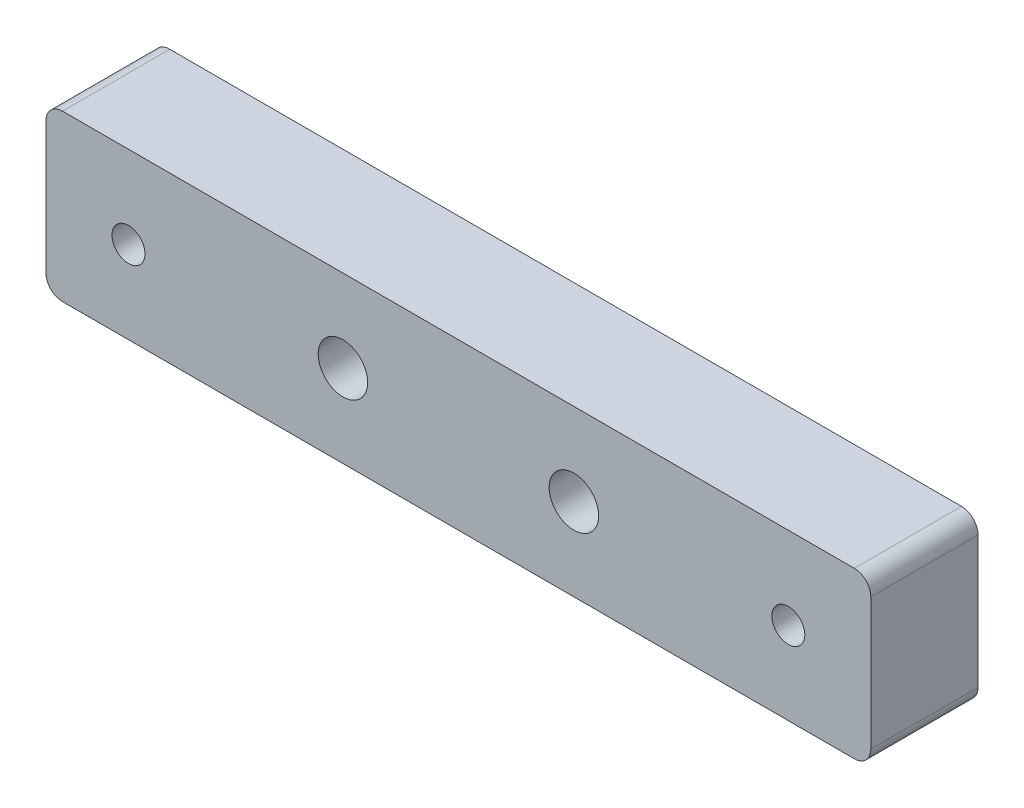
ISO-10303-21;
HEADER;
FILE_DESCRIPTION(('STEP AP214'),'2;1');
FILE_NAME('part.step','',(''),(''),'','','');
FILE_SCHEMA(('AUTOMOTIVE_DESIGN { 1 0 10303 214 1 1 1 1 }'));
ENDSEC;
DATA;
#1=APPLICATION_CONTEXT('core data for automotive mechanical design processes');
#2=APPLICATION_PROTOCOL_DEFINITION('international standard','automotive_design',2000,#1);
#3=PRODUCT_CONTEXT('',#1,'mechanical');
#4=PRODUCT('Part','Part','',(#3));
#5=PRODUCT_RELATED_PRODUCT_CATEGORY('part','',(#4));
#6=PRODUCT_DEFINITION_FORMATION('','',#4);
#7=PRODUCT_DEFINITION_CONTEXT('part definition',#1,'design');
#8=PRODUCT_DEFINITION('design','',#6,#7);
#9=PRODUCT_DEFINITION_SHAPE('','',#8);
#10=(LENGTH_UNIT() NAMED_UNIT(*) SI_UNIT(.MILLI.,.METRE.));
#11=(NAMED_UNIT(*) PLANE_ANGLE_UNIT() SI_UNIT($,.RADIAN.));
#12=(NAMED_UNIT(*) SI_UNIT($,.STERADIAN.) SOLID_ANGLE_UNIT());
#13=UNCERTAINTY_MEASURE_WITH_UNIT(LENGTH_MEASURE(1.E-05),#10,'distance_accuracy_value','');
#14=(GEOMETRIC_REPRESENTATION_CONTEXT(3) GLOBAL_UNCERTAINTY_ASSIGNED_CONTEXT((#13)) GLOBAL_UNIT_ASSIGNED_CONTEXT((#10,
#11,#12)) REPRESENTATION_CONTEXT('',''));
#15=CARTESIAN_POINT('',(0.,0.,0.));
#16=DIRECTION('',(0.,0.,1.));
#17=DIRECTION('',(1.,0.,0.));
#18=AXIS2_PLACEMENT_3D('',#15,#16,#17);
#19=CARTESIAN_POINT('',(0.,0.,13.));
#20=DIRECTION('',(0.,1.,0.));
#21=DIRECTION('',(0.,0.,1.));
#22=AXIS2_PLACEMENT_3D('',#19,#20,#21);
#23=PLANE('',#22);
#24=DIRECTION('',(0.,0.,1.));
#25=VECTOR('',#24,1.);
#26=CARTESIAN_POINT('',(2.00000000000001,0.,0.));
#27=LINE('',#26,#25);
#28=CARTESIAN_POINT('',(2.00000000000001,0.,0.));
#29=VERTEX_POINT('',#28);
#30=CARTESIAN_POINT('',(2.00000000000001,0.,13.));
#31=VERTEX_POINT('',#30);
#32=EDGE_CURVE('E177',#29,#31,#27,.T.);
#33=ORIENTED_EDGE('',*,*,#32,.F.);
#34=DIRECTION('',(1.,0.,0.));
#35=VECTOR('',#34,1.);
#36=CARTESIAN_POINT('',(0.,0.,0.));
#37=LINE('',#36,#35);
#38=CARTESIAN_POINT('',(98.,0.,0.));
#39=VERTEX_POINT('',#38);
#40=EDGE_CURVE('E120',#29,#39,#37,.T.);
#41=ORIENTED_EDGE('',*,*,#40,.T.);
#42=DIRECTION('',(0.,0.,1.));
#43=VECTOR('',#42,1.);
#44=CARTESIAN_POINT('',(98.,0.,0.));
#45=LINE('',#44,#43);
#46=CARTESIAN_POINT('',(98.,0.,13.));
#47=VERTEX_POINT('',#46);
#48=EDGE_CURVE('E49',#39,#47,#45,.T.);
#49=ORIENTED_EDGE('',*,*,#48,.T.);
#50=DIRECTION('',(1.,0.,0.));
#51=VECTOR('',#50,1.);
#52=CARTESIAN_POINT('',(0.,0.,13.));
#53=LINE('',#52,#51);
#54=EDGE_CURVE('E130',#31,#47,#53,.T.);
#55=ORIENTED_EDGE('',*,*,#54,.F.);
#56=EDGE_LOOP('',(#33,#41,#49,#55));
#57=FACE_BOUND('',#56,.T.);
#58=ADVANCED_FACE('F32',(#57),#23,.F.);
#59=CARTESIAN_POINT('',(100.,0.,13.));
#60=DIRECTION('',(-1.,0.,0.));
#61=DIRECTION('',(0.,0.,1.));
#62=AXIS2_PLACEMENT_3D('',#59,#60,#61);
#63=PLANE('',#62);
#64=DIRECTION('',(0.,0.,1.));
#65=VECTOR('',#64,1.);
#66=CARTESIAN_POINT('',(100.,2.00000000000001,0.));
#67=LINE('',#66,#65);
#68=CARTESIAN_POINT('',(100.,2.00000000000001,0.));
#69=VERTEX_POINT('',#68);
#70=CARTESIAN_POINT('',(100.,2.00000000000001,13.));
#71=VERTEX_POINT('',#70);
#72=EDGE_CURVE('E99',#69,#71,#67,.T.);
#73=ORIENTED_EDGE('',*,*,#72,.F.);
#74=DIRECTION('',(0.,1.,0.));
#75=VECTOR('',#74,1.);
#76=CARTESIAN_POINT('',(100.,0.,0.));
#77=LINE('',#76,#75);
#78=CARTESIAN_POINT('',(100.,18.,0.));
#79=VERTEX_POINT('',#78);
#80=EDGE_CURVE('E111',#69,#79,#77,.T.);
#81=ORIENTED_EDGE('',*,*,#80,.T.);
#82=DIRECTION('',(0.,0.,1.));
#83=VECTOR('',#82,1.);
#84=CARTESIAN_POINT('',(100.,18.,0.));
#85=LINE('',#84,#83);
#86=CARTESIAN_POINT('',(100.,18.,13.));
#87=VERTEX_POINT('',#86);
#88=EDGE_CURVE('E57',#79,#87,#85,.T.);
#89=ORIENTED_EDGE('',*,*,#88,.T.);
#90=DIRECTION('',(0.,1.,0.));
#91=VECTOR('',#90,1.);
#92=CARTESIAN_POINT('',(100.,0.,13.));
#93=LINE('',#92,#91);
#94=EDGE_CURVE('E41',#71,#87,#93,.T.);
#95=ORIENTED_EDGE('',*,*,#94,.F.);
#96=EDGE_LOOP('',(#73,#81,#89,#95));
#97=FACE_BOUND('',#96,.T.);
#98=ADVANCED_FACE('F110',(#97),#63,.F.);
#99=CARTESIAN_POINT('',(0.,20.,13.));
#100=DIRECTION('',(0.,-1.,0.));
#101=DIRECTION('',(0.,0.,-1.));
#102=AXIS2_PLACEMENT_3D('',#99,#100,#101);
#103=PLANE('',#102);
#104=DIRECTION('',(0.,0.,1.));
#105=VECTOR('',#104,1.);
#106=CARTESIAN_POINT('',(2.00000000000001,20.,0.));
#107=LINE('',#106,#105);
#108=CARTESIAN_POINT('',(2.,20.,0.));
#109=VERTEX_POINT('',#108);
#110=CARTESIAN_POINT('',(2.00000000000001,20.,13.));
#111=VERTEX_POINT('',#110);
#112=EDGE_CURVE('E166',#109,#111,#107,.T.);
#113=ORIENTED_EDGE('',*,*,#112,.T.);
#114=DIRECTION('',(-1.,0.,0.));
#115=VECTOR('',#114,1.);
#116=CARTESIAN_POINT('',(0.,20.,13.));
#117=LINE('',#116,#115);
#118=CARTESIAN_POINT('',(98.,20.,13.));
#119=VERTEX_POINT('',#118);
#120=EDGE_CURVE('E11',#119,#111,#117,.T.);
#121=ORIENTED_EDGE('',*,*,#120,.F.);
#122=DIRECTION('',(0.,0.,1.));
#123=VECTOR('',#122,1.);
#124=CARTESIAN_POINT('',(98.,20.,0.));
#125=LINE('',#124,#123);
#126=CARTESIAN_POINT('',(98.,20.,0.));
#127=VERTEX_POINT('',#126);
#128=EDGE_CURVE('E145',#127,#119,#125,.T.);
#129=ORIENTED_EDGE('',*,*,#128,.F.);
#130=DIRECTION('',(-1.,0.,0.));
#131=VECTOR('',#130,1.);
#132=CARTESIAN_POINT('',(0.,20.,0.));
#133=LINE('',#132,#131);
#134=EDGE_CURVE('E36',#127,#109,#133,.T.);
#135=ORIENTED_EDGE('',*,*,#134,.T.);
#136=EDGE_LOOP('',(#113,#121,#129,#135));
#137=FACE_BOUND('',#136,.T.);
#138=ADVANCED_FACE('F201',(#137),#103,.F.);
#139=CARTESIAN_POINT('',(0.,0.,13.));
#140=DIRECTION('',(0.,0.,-1.));
#141=DIRECTION('',(-1.,0.,0.));
#142=AXIS2_PLACEMENT_3D('',#139,#140,#141);
#143=PLANE('',#142);
#144=CARTESIAN_POINT('',(64.,10.,13.));
#145=DIRECTION('',(0.,0.,1.));
#146=DIRECTION('',(1.,0.,0.));
#147=AXIS2_PLACEMENT_3D('',#144,#145,#146);
#148=CIRCLE('',#147,3.00000000000001);
#149=CARTESIAN_POINT('',(67.,10.,13.));
#150=VERTEX_POINT('',#149);
#151=EDGE_CURVE('E135',#150,#150,#148,.T.);
#152=ORIENTED_EDGE('',*,*,#151,.F.);
#153=EDGE_LOOP('',(#152));
#154=FACE_BOUND('',#153,.T.);
#155=CARTESIAN_POINT('',(36.,10.,13.));
#156=DIRECTION('',(0.,0.,1.));
#157=DIRECTION('',(-1.,0.,0.));
#158=AXIS2_PLACEMENT_3D('',#155,#156,#157);
#159=CIRCLE('',#158,3.00000000000001);
#160=CARTESIAN_POINT('',(33.,10.,13.));
#161=VERTEX_POINT('',#160);
#162=EDGE_CURVE('E154',#161,#161,#159,.T.);
#163=ORIENTED_EDGE('',*,*,#162,.F.);
#164=EDGE_LOOP('',(#163));
#165=FACE_BOUND('',#164,.T.);
#166=CARTESIAN_POINT('',(10.,10.,13.));
#167=DIRECTION('',(0.,0.,1.));
#168=DIRECTION('',(1.,0.,0.));
#169=AXIS2_PLACEMENT_3D('',#166,#167,#168);
#170=CIRCLE('',#169,2.);
#171=CARTESIAN_POINT('',(12.,10.,13.));
#172=VERTEX_POINT('',#171);
#173=EDGE_CURVE('E148',#172,#172,#170,.T.);
#174=ORIENTED_EDGE('',*,*,#173,.F.);
#175=EDGE_LOOP('',(#174));
#176=FACE_BOUND('',#175,.T.);
#177=CARTESIAN_POINT('',(90.,10.,13.));
#178=DIRECTION('',(0.,0.,1.));
#179=DIRECTION('',(-1.,0.,0.));
#180=AXIS2_PLACEMENT_3D('',#177,#178,#179);
#181=CIRCLE('',#180,2.);
#182=CARTESIAN_POINT('',(88.,10.,13.));
#183=VERTEX_POINT('',#182);
#184=EDGE_CURVE('E141',#183,#183,#181,.T.);
#185=ORIENTED_EDGE('',*,*,#184,.F.);
#186=EDGE_LOOP('',(#185));
#187=FACE_BOUND('',#186,.T.);
#188=ORIENTED_EDGE('',*,*,#120,.T.);
#189=CARTESIAN_POINT('',(2.,18.,13.));
#190=DIRECTION('',(0.,0.,1.));
#191=DIRECTION('',(1.,0.,0.));
#192=AXIS2_PLACEMENT_3D('',#189,#190,#191);
#193=CIRCLE('',#192,2.);
#194=CARTESIAN_POINT('',(0.,18.,13.));
#195=VERTEX_POINT('',#194);
#196=EDGE_CURVE('E171',#195,#111,#193,.F.);
#197=ORIENTED_EDGE('',*,*,#196,.F.);
#198=DIRECTION('',(0.,-1.,0.));
#199=VECTOR('',#198,1.);
#200=CARTESIAN_POINT('',(0.,0.,13.));
#201=LINE('',#200,#199);
#202=CARTESIAN_POINT('',(0.,2.00000000000001,13.));
#203=VERTEX_POINT('',#202);
#204=EDGE_CURVE('E122',#195,#203,#201,.T.);
#205=ORIENTED_EDGE('',*,*,#204,.T.);
#206=CARTESIAN_POINT('',(2.,2.,13.));
#207=DIRECTION('',(0.,0.,1.));
#208=DIRECTION('',(1.,0.,0.));
#209=AXIS2_PLACEMENT_3D('',#206,#207,#208);
#210=CIRCLE('',#209,2.);
#211=EDGE_CURVE('E170',#203,#31,#210,.T.);
#212=ORIENTED_EDGE('',*,*,#211,.T.);
#213=ORIENTED_EDGE('',*,*,#54,.T.);
#214=CARTESIAN_POINT('',(98.,2.,13.));
#215=DIRECTION('',(0.,0.,1.));
#216=DIRECTION('',(1.,0.,0.));
#217=AXIS2_PLACEMENT_3D('',#214,#215,#216);
#218=CIRCLE('',#217,2.);
#219=EDGE_CURVE('E105',#47,#71,#218,.T.);
#220=ORIENTED_EDGE('',*,*,#219,.T.);
#221=ORIENTED_EDGE('',*,*,#94,.T.);
#222=CARTESIAN_POINT('',(98.,18.,13.));
#223=DIRECTION('',(0.,0.,1.));
#224=DIRECTION('',(1.,0.,0.));
#225=AXIS2_PLACEMENT_3D('',#222,#223,#224);
#226=CIRCLE('',#225,2.);
#227=EDGE_CURVE('E113',#87,#119,#226,.T.);
#228=ORIENTED_EDGE('',*,*,#227,.T.);
#229=EDGE_LOOP('',(#188,#197,#205,#212,#213,#220,#221,#228));
#230=FACE_BOUND('',#229,.T.);
#231=ADVANCED_FACE('F185',(#154,#165,#176,#187,#230),#143,.F.);
#232=CARTESIAN_POINT('',(0.,0.,0.));
#233=DIRECTION('',(0.,0.,-1.));
#234=DIRECTION('',(-1.,0.,0.));
#235=AXIS2_PLACEMENT_3D('',#232,#233,#234);
#236=PLANE('',#235);
#237=CARTESIAN_POINT('',(2.,18.,0.));
#238=DIRECTION('',(0.,0.,1.));
#239=DIRECTION('',(1.,0.,0.));
#240=AXIS2_PLACEMENT_3D('',#237,#238,#239);
#241=CIRCLE('',#240,2.);
#242=CARTESIAN_POINT('',(0.,18.,0.));
#243=VERTEX_POINT('',#242);
#244=EDGE_CURVE('E167',#243,#109,#241,.F.);
#245=ORIENTED_EDGE('',*,*,#244,.T.);
#246=ORIENTED_EDGE('',*,*,#134,.F.);
#247=CARTESIAN_POINT('',(98.,18.,0.));
#248=DIRECTION('',(0.,0.,1.));
#249=DIRECTION('',(1.,0.,0.));
#250=AXIS2_PLACEMENT_3D('',#247,#248,#249);
#251=CIRCLE('',#250,2.);
#252=EDGE_CURVE('E119',#79,#127,#251,.T.);
#253=ORIENTED_EDGE('',*,*,#252,.F.);
#254=ORIENTED_EDGE('',*,*,#80,.F.);
#255=CARTESIAN_POINT('',(98.,2.,0.));
#256=DIRECTION('',(0.,0.,1.));
#257=DIRECTION('',(1.,0.,0.));
#258=AXIS2_PLACEMENT_3D('',#255,#256,#257);
#259=CIRCLE('',#258,2.);
#260=EDGE_CURVE('E96',#39,#69,#259,.T.);
#261=ORIENTED_EDGE('',*,*,#260,.F.);
#262=ORIENTED_EDGE('',*,*,#40,.F.);
#263=CARTESIAN_POINT('',(2.,2.,0.));
#264=DIRECTION('',(0.,0.,1.));
#265=DIRECTION('',(1.,0.,0.));
#266=AXIS2_PLACEMENT_3D('',#263,#264,#265);
#267=CIRCLE('',#266,2.);
#268=CARTESIAN_POINT('',(0.,2.00000000000001,0.));
#269=VERTEX_POINT('',#268);
#270=EDGE_CURVE('E178',#269,#29,#267,.T.);
#271=ORIENTED_EDGE('',*,*,#270,.F.);
#272=DIRECTION('',(0.,-1.,0.));
#273=VECTOR('',#272,1.);
#274=CARTESIAN_POINT('',(0.,0.,0.));
#275=LINE('',#274,#273);
#276=EDGE_CURVE('E123',#243,#269,#275,.T.);
#277=ORIENTED_EDGE('',*,*,#276,.F.);
#278=EDGE_LOOP('',(#245,#246,#253,#254,#261,#262,#271,#277));
#279=FACE_BOUND('',#278,.T.);
#280=CARTESIAN_POINT('',(90.,10.,0.));
#281=DIRECTION('',(0.,0.,1.));
#282=DIRECTION('',(-1.,0.,0.));
#283=AXIS2_PLACEMENT_3D('',#280,#281,#282);
#284=CIRCLE('',#283,2.);
#285=CARTESIAN_POINT('',(88.,10.,0.));
#286=VERTEX_POINT('',#285);
#287=EDGE_CURVE('E144',#286,#286,#284,.T.);
#288=ORIENTED_EDGE('',*,*,#287,.T.);
#289=EDGE_LOOP('',(#288));
#290=FACE_BOUND('',#289,.T.);
#291=CARTESIAN_POINT('',(10.,10.,0.));
#292=DIRECTION('',(0.,0.,1.));
#293=DIRECTION('',(1.,0.,0.));
#294=AXIS2_PLACEMENT_3D('',#291,#292,#293);
#295=CIRCLE('',#294,2.);
#296=CARTESIAN_POINT('',(12.,10.,0.));
#297=VERTEX_POINT('',#296);
#298=EDGE_CURVE('E151',#297,#297,#295,.T.);
#299=ORIENTED_EDGE('',*,*,#298,.T.);
#300=EDGE_LOOP('',(#299));
#301=FACE_BOUND('',#300,.T.);
#302=CARTESIAN_POINT('',(36.,10.,0.));
#303=DIRECTION('',(0.,0.,1.));
#304=DIRECTION('',(-1.,0.,0.));
#305=AXIS2_PLACEMENT_3D('',#302,#303,#304);
#306=CIRCLE('',#305,3.00000000000001);
#307=CARTESIAN_POINT('',(33.,10.,0.));
#308=VERTEX_POINT('',#307);
#309=EDGE_CURVE('E138',#308,#308,#306,.T.);
#310=ORIENTED_EDGE('',*,*,#309,.T.);
#311=EDGE_LOOP('',(#310));
#312=FACE_BOUND('',#311,.T.);
#313=CARTESIAN_POINT('',(64.,10.,0.));
#314=DIRECTION('',(0.,0.,1.));
#315=DIRECTION('',(1.,0.,0.));
#316=AXIS2_PLACEMENT_3D('',#313,#314,#315);
#317=CIRCLE('',#316,3.00000000000001);
#318=CARTESIAN_POINT('',(67.,10.,0.));
#319=VERTEX_POINT('',#318);
#320=EDGE_CURVE('E127',#319,#319,#317,.T.);
#321=ORIENTED_EDGE('',*,*,#320,.T.);
#322=EDGE_LOOP('',(#321));
#323=FACE_BOUND('',#322,.T.);
#324=ADVANCED_FACE('F116',(#279,#290,#301,#312,#323),#236,.T.);
#325=CARTESIAN_POINT('',(0.,0.,13.));
#326=DIRECTION('',(1.,0.,0.));
#327=DIRECTION('',(0.,0.,-1.));
#328=AXIS2_PLACEMENT_3D('',#325,#326,#327);
#329=PLANE('',#328);
#330=ORIENTED_EDGE('',*,*,#204,.F.);
#331=DIRECTION('',(0.,0.,1.));
#332=VECTOR('',#331,1.);
#333=CARTESIAN_POINT('',(0.,18.,0.));
#334=LINE('',#333,#332);
#335=EDGE_CURVE('E164',#243,#195,#334,.T.);
#336=ORIENTED_EDGE('',*,*,#335,.F.);
#337=ORIENTED_EDGE('',*,*,#276,.T.);
#338=DIRECTION('',(0.,0.,1.));
#339=VECTOR('',#338,1.);
#340=CARTESIAN_POINT('',(0.,2.00000000000001,0.));
#341=LINE('',#340,#339);
#342=EDGE_CURVE('E174',#269,#203,#341,.T.);
#343=ORIENTED_EDGE('',*,*,#342,.T.);
#344=EDGE_LOOP('',(#330,#336,#337,#343));
#345=FACE_BOUND('',#344,.T.);
#346=ADVANCED_FACE('F34',(#345),#329,.F.);
#347=CARTESIAN_POINT('',(64.,10.,0.));
#348=DIRECTION('',(0.,0.,1.));
#349=DIRECTION('',(1.,0.,0.));
#350=AXIS2_PLACEMENT_3D('',#347,#348,#349);
#351=CYLINDRICAL_SURFACE('',#350,3.00000000000001);
#352=ORIENTED_EDGE('',*,*,#320,.F.);
#353=EDGE_LOOP('',(#352));
#354=FACE_BOUND('',#353,.T.);
#355=ORIENTED_EDGE('',*,*,#151,.T.);
#356=EDGE_LOOP('',(#355));
#357=FACE_BOUND('',#356,.T.);
#358=ADVANCED_FACE('F230',(#354,#357),#351,.F.);
#359=CARTESIAN_POINT('',(36.,10.,0.));
#360=DIRECTION('',(0.,0.,1.));
#361=DIRECTION('',(1.,0.,0.));
#362=AXIS2_PLACEMENT_3D('',#359,#360,#361);
#363=CYLINDRICAL_SURFACE('',#362,3.00000000000001);
#364=ORIENTED_EDGE('',*,*,#309,.F.);
#365=EDGE_LOOP('',(#364));
#366=FACE_BOUND('',#365,.T.);
#367=ORIENTED_EDGE('',*,*,#162,.T.);
#368=EDGE_LOOP('',(#367));
#369=FACE_BOUND('',#368,.T.);
#370=ADVANCED_FACE('F232',(#366,#369),#363,.F.);
#371=CARTESIAN_POINT('',(10.,10.,0.));
#372=DIRECTION('',(0.,0.,1.));
#373=DIRECTION('',(1.,0.,0.));
#374=AXIS2_PLACEMENT_3D('',#371,#372,#373);
#375=CYLINDRICAL_SURFACE('',#374,2.);
#376=ORIENTED_EDGE('',*,*,#298,.F.);
#377=EDGE_LOOP('',(#376));
#378=FACE_BOUND('',#377,.T.);
#379=ORIENTED_EDGE('',*,*,#173,.T.);
#380=EDGE_LOOP('',(#379));
#381=FACE_BOUND('',#380,.T.);
#382=ADVANCED_FACE('F212',(#378,#381),#375,.F.);
#383=CARTESIAN_POINT('',(90.,10.,0.));
#384=DIRECTION('',(0.,0.,1.));
#385=DIRECTION('',(1.,0.,0.));
#386=AXIS2_PLACEMENT_3D('',#383,#384,#385);
#387=CYLINDRICAL_SURFACE('',#386,2.);
#388=ORIENTED_EDGE('',*,*,#287,.F.);
#389=EDGE_LOOP('',(#388));
#390=FACE_BOUND('',#389,.T.);
#391=ORIENTED_EDGE('',*,*,#184,.T.);
#392=EDGE_LOOP('',(#391));
#393=FACE_BOUND('',#392,.T.);
#394=ADVANCED_FACE('F204',(#390,#393),#387,.F.);
#395=CARTESIAN_POINT('',(98.,18.,0.));
#396=DIRECTION('',(0.,0.,1.));
#397=DIRECTION('',(1.,0.,0.));
#398=AXIS2_PLACEMENT_3D('',#395,#396,#397);
#399=CYLINDRICAL_SURFACE('',#398,2.);
#400=ORIENTED_EDGE('',*,*,#227,.F.);
#401=ORIENTED_EDGE('',*,*,#88,.F.);
#402=ORIENTED_EDGE('',*,*,#252,.T.);
#403=ORIENTED_EDGE('',*,*,#128,.T.);
#404=EDGE_LOOP('',(#400,#401,#402,#403));
#405=FACE_BOUND('',#404,.T.);
#406=ADVANCED_FACE('F202',(#405),#399,.T.);
#407=CARTESIAN_POINT('',(98.,2.,0.));
#408=DIRECTION('',(0.,0.,1.));
#409=DIRECTION('',(1.,0.,0.));
#410=AXIS2_PLACEMENT_3D('',#407,#408,#409);
#411=CYLINDRICAL_SURFACE('',#410,2.);
#412=ORIENTED_EDGE('',*,*,#219,.F.);
#413=ORIENTED_EDGE('',*,*,#48,.F.);
#414=ORIENTED_EDGE('',*,*,#260,.T.);
#415=ORIENTED_EDGE('',*,*,#72,.T.);
#416=EDGE_LOOP('',(#412,#413,#414,#415));
#417=FACE_BOUND('',#416,.T.);
#418=ADVANCED_FACE('F98',(#417),#411,.T.);
#419=CARTESIAN_POINT('',(2.,2.,0.));
#420=DIRECTION('',(0.,0.,1.));
#421=DIRECTION('',(1.,0.,0.));
#422=AXIS2_PLACEMENT_3D('',#419,#420,#421);
#423=CYLINDRICAL_SURFACE('',#422,2.);
#424=ORIENTED_EDGE('',*,*,#211,.F.);
#425=ORIENTED_EDGE('',*,*,#342,.F.);
#426=ORIENTED_EDGE('',*,*,#270,.T.);
#427=ORIENTED_EDGE('',*,*,#32,.T.);
#428=EDGE_LOOP('',(#424,#425,#426,#427));
#429=FACE_BOUND('',#428,.T.);
#430=ADVANCED_FACE('F210',(#429),#423,.T.);
#431=CARTESIAN_POINT('',(2.,18.,0.));
#432=DIRECTION('',(0.,0.,1.));
#433=DIRECTION('',(1.,0.,0.));
#434=AXIS2_PLACEMENT_3D('',#431,#432,#433);
#435=CYLINDRICAL_SURFACE('',#434,2.);
#436=ORIENTED_EDGE('',*,*,#196,.T.);
#437=ORIENTED_EDGE('',*,*,#112,.F.);
#438=ORIENTED_EDGE('',*,*,#244,.F.);
#439=ORIENTED_EDGE('',*,*,#335,.T.);
#440=EDGE_LOOP('',(#436,#437,#438,#439));
#441=FACE_BOUND('',#440,.T.);
#442=ADVANCED_FACE('F197',(#441),#435,.T.);
#443=CLOSED_SHELL('',(#58,#98,#138,#231,#324,#346,#358,#370,#382,#394,#406,#418,#430,#442));
#444=MANIFOLD_SOLID_BREP('B2',#443);
#445=ADVANCED_BREP_SHAPE_REPRESENTATION('',(#18,#444),#14);
#446=SHAPE_DEFINITION_REPRESENTATION(#9,#445);
ENDSEC;
END-ISO-10303-21;
